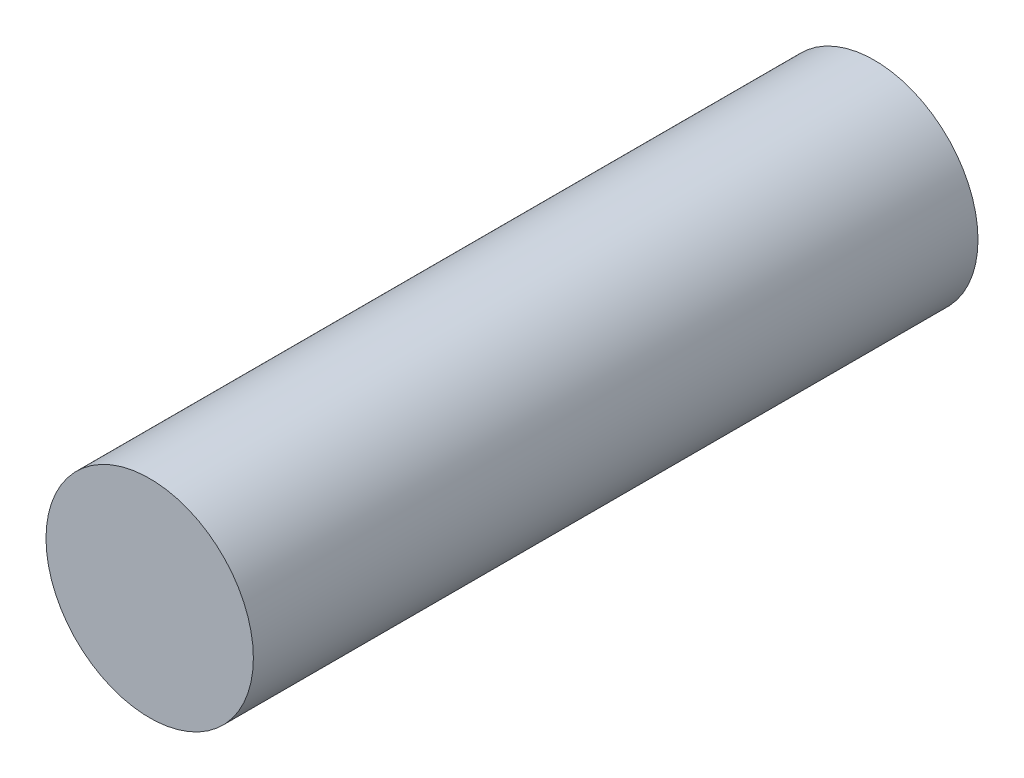
ISO-10303-21;
HEADER;
FILE_DESCRIPTION(('STEP AP214'),'2;1');
FILE_NAME('part.step','',(''),(''),'','','');
FILE_SCHEMA(('AUTOMOTIVE_DESIGN { 1 0 10303 214 1 1 1 1 }'));
ENDSEC;
DATA;
#1=APPLICATION_CONTEXT('core data for automotive mechanical design processes');
#2=APPLICATION_PROTOCOL_DEFINITION('international standard','automotive_design',2000,#1);
#3=PRODUCT_CONTEXT('',#1,'mechanical');
#4=PRODUCT('Part','Part','',(#3));
#5=PRODUCT_RELATED_PRODUCT_CATEGORY('part','',(#4));
#6=PRODUCT_DEFINITION_FORMATION('','',#4);
#7=PRODUCT_DEFINITION_CONTEXT('part definition',#1,'design');
#8=PRODUCT_DEFINITION('design','',#6,#7);
#9=PRODUCT_DEFINITION_SHAPE('','',#8);
#10=(LENGTH_UNIT() NAMED_UNIT(*) SI_UNIT(.MILLI.,.METRE.));
#11=(NAMED_UNIT(*) PLANE_ANGLE_UNIT() SI_UNIT($,.RADIAN.));
#12=(NAMED_UNIT(*) SI_UNIT($,.STERADIAN.) SOLID_ANGLE_UNIT());
#13=UNCERTAINTY_MEASURE_WITH_UNIT(LENGTH_MEASURE(1.E-05),#10,'distance_accuracy_value','');
#14=(GEOMETRIC_REPRESENTATION_CONTEXT(3) GLOBAL_UNCERTAINTY_ASSIGNED_CONTEXT((#13)) GLOBAL_UNIT_ASSIGNED_CONTEXT((#10,
#11,#12)) REPRESENTATION_CONTEXT('',''));
#15=CARTESIAN_POINT('',(0.,0.,0.));
#16=DIRECTION('',(0.,0.,1.));
#17=DIRECTION('',(1.,0.,0.));
#18=AXIS2_PLACEMENT_3D('',#15,#16,#17);
#19=CARTESIAN_POINT('',(0.,0.,65.));
#20=DIRECTION('',(0.,0.,-1.));
#21=DIRECTION('',(-1.,0.,0.));
#22=AXIS2_PLACEMENT_3D('',#19,#20,#21);
#23=CYLINDRICAL_SURFACE('',#22,9.3);
#24=CARTESIAN_POINT('',(0.,0.,65.));
#25=DIRECTION('',(0.,0.,1.));
#26=DIRECTION('',(1.,0.,0.));
#27=AXIS2_PLACEMENT_3D('',#24,#25,#26);
#28=CIRCLE('',#27,9.3);
#29=CARTESIAN_POINT('',(9.3,0.,65.));
#30=VERTEX_POINT('',#29);
#31=EDGE_CURVE('E10',#30,#30,#28,.T.);
#32=ORIENTED_EDGE('',*,*,#31,.F.);
#33=EDGE_LOOP('',(#32));
#34=FACE_BOUND('',#33,.T.);
#35=CARTESIAN_POINT('',(0.,0.,0.));
#36=DIRECTION('',(0.,0.,1.));
#37=DIRECTION('',(1.,0.,0.));
#38=AXIS2_PLACEMENT_3D('',#35,#36,#37);
#39=CIRCLE('',#38,9.3);
#40=CARTESIAN_POINT('',(9.3,0.,0.));
#41=VERTEX_POINT('',#40);
#42=EDGE_CURVE('E36',#41,#41,#39,.T.);
#43=ORIENTED_EDGE('',*,*,#42,.T.);
#44=EDGE_LOOP('',(#43));
#45=FACE_BOUND('',#44,.T.);
#46=ADVANCED_FACE('F33',(#34,#45),#23,.T.);
#47=CARTESIAN_POINT('',(0.,0.,65.));
#48=DIRECTION('',(0.,0.,1.));
#49=DIRECTION('',(1.,0.,0.));
#50=AXIS2_PLACEMENT_3D('',#47,#48,#49);
#51=PLANE('',#50);
#52=ORIENTED_EDGE('',*,*,#31,.T.);
#53=EDGE_LOOP('',(#52));
#54=FACE_BOUND('',#53,.T.);
#55=ADVANCED_FACE('F48',(#54),#51,.T.);
#56=CARTESIAN_POINT('',(0.,0.,0.));
#57=DIRECTION('',(0.,0.,1.));
#58=DIRECTION('',(1.,0.,0.));
#59=AXIS2_PLACEMENT_3D('',#56,#57,#58);
#60=PLANE('',#59);
#61=ORIENTED_EDGE('',*,*,#42,.F.);
#62=EDGE_LOOP('',(#61));
#63=FACE_BOUND('',#62,.T.);
#64=ADVANCED_FACE('F46',(#63),#60,.F.);
#65=CLOSED_SHELL('',(#46,#55,#64));
#66=MANIFOLD_SOLID_BREP('B2',#65);
#67=ADVANCED_BREP_SHAPE_REPRESENTATION('',(#18,#66),#14);
#68=SHAPE_DEFINITION_REPRESENTATION(#9,#67);
ENDSEC;
END-ISO-10303-21;
